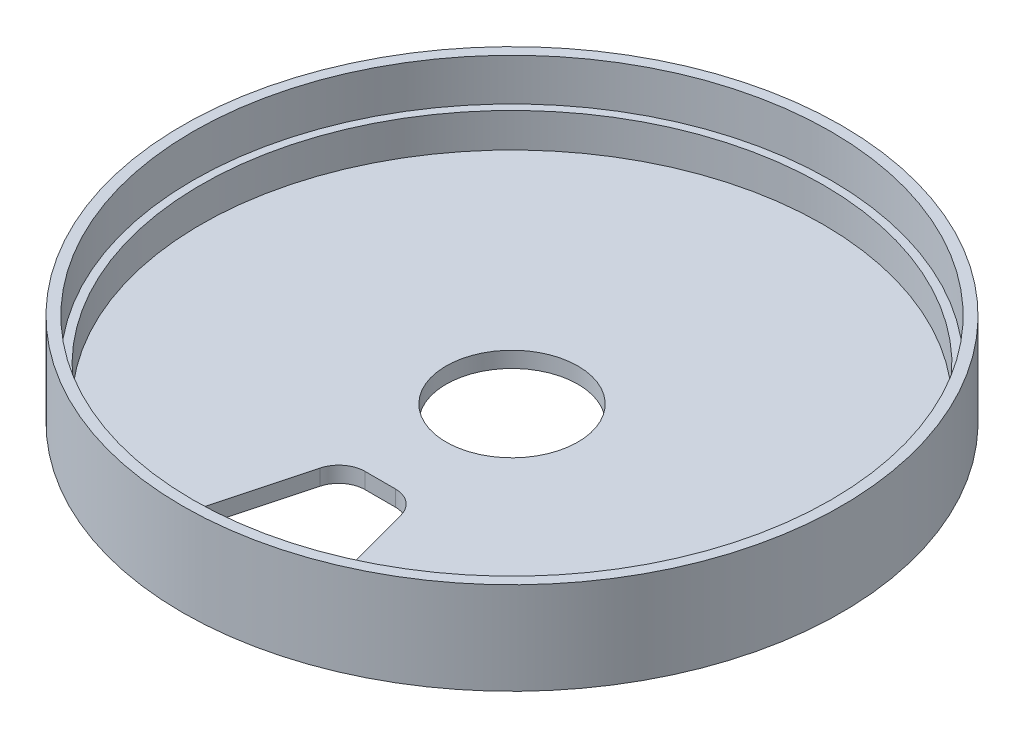
ISO-10303-21;
HEADER;
FILE_DESCRIPTION(('STEP AP214'),'2;1');
FILE_NAME('part.step','',(''),(''),'','','');
FILE_SCHEMA(('AUTOMOTIVE_DESIGN { 1 0 10303 214 1 1 1 1 }'));
ENDSEC;
DATA;
#1=APPLICATION_CONTEXT('core data for automotive mechanical design processes');
#2=APPLICATION_PROTOCOL_DEFINITION('international standard','automotive_design',2000,#1);
#3=PRODUCT_CONTEXT('',#1,'mechanical');
#4=PRODUCT('Part','Part','',(#3));
#5=PRODUCT_RELATED_PRODUCT_CATEGORY('part','',(#4));
#6=PRODUCT_DEFINITION_FORMATION('','',#4);
#7=PRODUCT_DEFINITION_CONTEXT('part definition',#1,'design');
#8=PRODUCT_DEFINITION('design','',#6,#7);
#9=PRODUCT_DEFINITION_SHAPE('','',#8);
#10=(LENGTH_UNIT() NAMED_UNIT(*) SI_UNIT(.MILLI.,.METRE.));
#11=(NAMED_UNIT(*) PLANE_ANGLE_UNIT() SI_UNIT($,.RADIAN.));
#12=(NAMED_UNIT(*) SI_UNIT($,.STERADIAN.) SOLID_ANGLE_UNIT());
#13=UNCERTAINTY_MEASURE_WITH_UNIT(LENGTH_MEASURE(1.E-05),#10,'distance_accuracy_value','');
#14=(GEOMETRIC_REPRESENTATION_CONTEXT(3) GLOBAL_UNCERTAINTY_ASSIGNED_CONTEXT((#13)) GLOBAL_UNIT_ASSIGNED_CONTEXT((#10,
#11,#12)) REPRESENTATION_CONTEXT('',''));
#15=CARTESIAN_POINT('',(0.,0.,0.));
#16=DIRECTION('',(0.,0.,1.));
#17=DIRECTION('',(1.,0.,0.));
#18=AXIS2_PLACEMENT_3D('',#15,#16,#17);
#19=CARTESIAN_POINT('',(0.,0.,0.));
#20=DIRECTION('',(0.,-1.,0.));
#21=DIRECTION('',(0.,0.,-1.));
#22=AXIS2_PLACEMENT_3D('',#19,#20,#21);
#23=CYLINDRICAL_SURFACE('',#22,12.5);
#24=CARTESIAN_POINT('',(0.,0.,0.));
#25=DIRECTION('',(0.,-1.,0.));
#26=DIRECTION('',(0.,0.,-1.));
#27=AXIS2_PLACEMENT_3D('',#24,#25,#26);
#28=CIRCLE('',#27,12.5);
#29=CARTESIAN_POINT('',(0.,0.,-12.5));
#30=VERTEX_POINT('',#29);
#31=EDGE_CURVE('E207',#30,#30,#28,.T.);
#32=ORIENTED_EDGE('',*,*,#31,.T.);
#33=EDGE_LOOP('',(#32));
#34=FACE_BOUND('',#33,.T.);
#35=CARTESIAN_POINT('',(0.,3.,0.));
#36=DIRECTION('',(0.,-1.,0.));
#37=DIRECTION('',(0.,0.,-1.));
#38=AXIS2_PLACEMENT_3D('',#35,#36,#37);
#39=CIRCLE('',#38,12.5);
#40=CARTESIAN_POINT('',(0.,3.,-12.5));
#41=VERTEX_POINT('',#40);
#42=EDGE_CURVE('E162',#41,#41,#39,.T.);
#43=ORIENTED_EDGE('',*,*,#42,.F.);
#44=EDGE_LOOP('',(#43));
#45=FACE_BOUND('',#44,.T.);
#46=ADVANCED_FACE('F41',(#34,#45),#23,.F.);
#47=CARTESIAN_POINT('',(12.5,0.,0.));
#48=DIRECTION('',(0.,-1.,0.));
#49=DIRECTION('',(0.,0.,-1.));
#50=AXIS2_PLACEMENT_3D('',#47,#48,#49);
#51=PLANE('',#50);
#52=DIRECTION('',(1.,0.,0.));
#53=VECTOR('',#52,1.);
#54=CARTESIAN_POINT('',(0.,0.,25.));
#55=LINE('',#54,#53);
#56=CARTESIAN_POINT('',(-2.86209487088327,0.,25.));
#57=VERTEX_POINT('',#56);
#58=CARTESIAN_POINT('',(2.86209487088327,0.,25.));
#59=VERTEX_POINT('',#58);
#60=EDGE_CURVE('E157',#57,#59,#55,.T.);
#61=ORIENTED_EDGE('',*,*,#60,.F.);
#62=CARTESIAN_POINT('',(-2.86209487088327,0.,30.));
#63=DIRECTION('',(0.,-1.,0.));
#64=DIRECTION('',(0.,0.,-1.));
#65=AXIS2_PLACEMENT_3D('',#62,#63,#64);
#66=CIRCLE('',#65,5.);
#67=CARTESIAN_POINT('',(-7.69172400232861,0.,28.7059047744874));
#68=VERTEX_POINT('',#67);
#69=EDGE_CURVE('E50',#57,#68,#66,.F.);
#70=ORIENTED_EDGE('',*,*,#69,.T.);
#71=DIRECTION('',(-0.258819045102521,0.,0.965925826289068));
#72=VECTOR('',#71,1.);
#73=CARTESIAN_POINT('',(0.,0.,0.));
#74=LINE('',#73,#72);
#75=CARTESIAN_POINT('',(-12.876084918047,0.,48.0542031167227));
#76=VERTEX_POINT('',#75);
#77=EDGE_CURVE('E156',#68,#76,#74,.T.);
#78=ORIENTED_EDGE('',*,*,#77,.T.);
#79=CARTESIAN_POINT('',(-8.04645578660166,0.,49.3482983422353));
#80=DIRECTION('',(0.,-1.,0.));
#81=DIRECTION('',(0.,0.,-1.));
#82=AXIS2_PLACEMENT_3D('',#79,#80,#81);
#83=CIRCLE('',#82,5.);
#84=CARTESIAN_POINT('',(-8.85110136526182,0.,54.2831281764588));
#85=VERTEX_POINT('',#84);
#86=EDGE_CURVE('E141',#76,#85,#83,.F.);
#87=ORIENTED_EDGE('',*,*,#86,.T.);
#88=CARTESIAN_POINT('',(0.,0.,0.));
#89=DIRECTION('',(0.,-1.,0.));
#90=DIRECTION('',(0.,0.,-1.));
#91=AXIS2_PLACEMENT_3D('',#88,#89,#90);
#92=CIRCLE('',#91,55.);
#93=CARTESIAN_POINT('',(8.85110136526182,0.,54.2831281764588));
#94=VERTEX_POINT('',#93);
#95=EDGE_CURVE('E115',#94,#85,#92,.T.);
#96=ORIENTED_EDGE('',*,*,#95,.F.);
#97=CARTESIAN_POINT('',(8.04645578660166,0.,49.3482983422353));
#98=DIRECTION('',(0.,-1.,0.));
#99=DIRECTION('',(0.,0.,-1.));
#100=AXIS2_PLACEMENT_3D('',#97,#98,#99);
#101=CIRCLE('',#100,5.);
#102=CARTESIAN_POINT('',(12.876084918047,0.,48.0542031167227));
#103=VERTEX_POINT('',#102);
#104=EDGE_CURVE('E181',#94,#103,#101,.F.);
#105=ORIENTED_EDGE('',*,*,#104,.T.);
#106=DIRECTION('',(0.258819045102521,0.,0.965925826289068));
#107=VECTOR('',#106,1.);
#108=CARTESIAN_POINT('',(0.,0.,0.));
#109=LINE('',#108,#107);
#110=CARTESIAN_POINT('',(7.69172400232861,0.,28.7059047744874));
#111=VERTEX_POINT('',#110);
#112=EDGE_CURVE('E185',#111,#103,#109,.T.);
#113=ORIENTED_EDGE('',*,*,#112,.F.);
#114=CARTESIAN_POINT('',(2.86209487088327,0.,30.));
#115=DIRECTION('',(0.,-1.,0.));
#116=DIRECTION('',(0.,0.,-1.));
#117=AXIS2_PLACEMENT_3D('',#114,#115,#116);
#118=CIRCLE('',#117,5.);
#119=EDGE_CURVE('E57',#111,#59,#118,.F.);
#120=ORIENTED_EDGE('',*,*,#119,.T.);
#121=EDGE_LOOP('',(#61,#70,#78,#87,#96,#105,#113,#120));
#122=FACE_BOUND('',#121,.T.);
#123=CARTESIAN_POINT('',(0.,0.,0.));
#124=DIRECTION('',(0.,-1.,0.));
#125=DIRECTION('',(0.,0.,-1.));
#126=AXIS2_PLACEMENT_3D('',#123,#124,#125);
#127=CIRCLE('',#126,62.5);
#128=CARTESIAN_POINT('',(0.,0.,-62.5));
#129=VERTEX_POINT('',#128);
#130=EDGE_CURVE('E211',#129,#129,#127,.T.);
#131=ORIENTED_EDGE('',*,*,#130,.T.);
#132=EDGE_LOOP('',(#131));
#133=FACE_BOUND('',#132,.T.);
#134=ORIENTED_EDGE('',*,*,#31,.F.);
#135=EDGE_LOOP('',(#134));
#136=FACE_BOUND('',#135,.T.);
#137=ADVANCED_FACE('F154',(#122,#133,#136),#51,.T.);
#138=CARTESIAN_POINT('',(0.,0.,0.));
#139=DIRECTION('',(0.,-1.,0.));
#140=DIRECTION('',(0.,0.,-1.));
#141=AXIS2_PLACEMENT_3D('',#138,#139,#140);
#142=CYLINDRICAL_SURFACE('',#141,62.5);
#143=CARTESIAN_POINT('',(0.,17.5,0.));
#144=DIRECTION('',(0.,-1.,0.));
#145=DIRECTION('',(0.,0.,-1.));
#146=AXIS2_PLACEMENT_3D('',#143,#144,#145);
#147=CIRCLE('',#146,62.5);
#148=CARTESIAN_POINT('',(0.,17.5,-62.5));
#149=VERTEX_POINT('',#148);
#150=EDGE_CURVE('E215',#149,#149,#147,.T.);
#151=ORIENTED_EDGE('',*,*,#150,.T.);
#152=EDGE_LOOP('',(#151));
#153=FACE_BOUND('',#152,.T.);
#154=ORIENTED_EDGE('',*,*,#130,.F.);
#155=EDGE_LOOP('',(#154));
#156=FACE_BOUND('',#155,.T.);
#157=ADVANCED_FACE('F259',(#153,#156),#142,.T.);
#158=CARTESIAN_POINT('',(62.5,17.5,0.));
#159=DIRECTION('',(0.,1.,0.));
#160=DIRECTION('',(0.,0.,1.));
#161=AXIS2_PLACEMENT_3D('',#158,#159,#160);
#162=PLANE('',#161);
#163=CARTESIAN_POINT('',(0.,17.5,0.));
#164=DIRECTION('',(0.,-1.,0.));
#165=DIRECTION('',(0.,0.,-1.));
#166=AXIS2_PLACEMENT_3D('',#163,#164,#165);
#167=CIRCLE('',#166,60.5);
#168=CARTESIAN_POINT('',(0.,17.5,-60.5));
#169=VERTEX_POINT('',#168);
#170=EDGE_CURVE('E219',#169,#169,#167,.T.);
#171=ORIENTED_EDGE('',*,*,#170,.T.);
#172=EDGE_LOOP('',(#171));
#173=FACE_BOUND('',#172,.T.);
#174=ORIENTED_EDGE('',*,*,#150,.F.);
#175=EDGE_LOOP('',(#174));
#176=FACE_BOUND('',#175,.T.);
#177=ADVANCED_FACE('F290',(#173,#176),#162,.T.);
#178=CARTESIAN_POINT('',(0.,0.,0.));
#179=DIRECTION('',(0.,-1.,0.));
#180=DIRECTION('',(0.,0.,-1.));
#181=AXIS2_PLACEMENT_3D('',#178,#179,#180);
#182=CYLINDRICAL_SURFACE('',#181,60.5);
#183=CARTESIAN_POINT('',(0.,9.5,0.));
#184=DIRECTION('',(0.,-1.,0.));
#185=DIRECTION('',(0.,0.,-1.));
#186=AXIS2_PLACEMENT_3D('',#183,#184,#185);
#187=CIRCLE('',#186,60.5);
#188=CARTESIAN_POINT('',(0.,9.5,-60.5));
#189=VERTEX_POINT('',#188);
#190=EDGE_CURVE('E223',#189,#189,#187,.T.);
#191=ORIENTED_EDGE('',*,*,#190,.T.);
#192=EDGE_LOOP('',(#191));
#193=FACE_BOUND('',#192,.T.);
#194=ORIENTED_EDGE('',*,*,#170,.F.);
#195=EDGE_LOOP('',(#194));
#196=FACE_BOUND('',#195,.T.);
#197=ADVANCED_FACE('F286',(#193,#196),#182,.F.);
#198=CARTESIAN_POINT('',(60.5,9.5,0.));
#199=DIRECTION('',(0.,1.,0.));
#200=DIRECTION('',(0.,0.,1.));
#201=AXIS2_PLACEMENT_3D('',#198,#199,#200);
#202=PLANE('',#201);
#203=CARTESIAN_POINT('',(0.,9.5,0.));
#204=DIRECTION('',(0.,-1.,0.));
#205=DIRECTION('',(0.,0.,-1.));
#206=AXIS2_PLACEMENT_3D('',#203,#204,#205);
#207=CIRCLE('',#206,59.);
#208=CARTESIAN_POINT('',(0.,9.5,-59.));
#209=VERTEX_POINT('',#208);
#210=EDGE_CURVE('E227',#209,#209,#207,.T.);
#211=ORIENTED_EDGE('',*,*,#210,.T.);
#212=EDGE_LOOP('',(#211));
#213=FACE_BOUND('',#212,.T.);
#214=ORIENTED_EDGE('',*,*,#190,.F.);
#215=EDGE_LOOP('',(#214));
#216=FACE_BOUND('',#215,.T.);
#217=ADVANCED_FACE('F282',(#213,#216),#202,.T.);
#218=CARTESIAN_POINT('',(0.,0.,0.));
#219=DIRECTION('',(0.,-1.,0.));
#220=DIRECTION('',(0.,0.,-1.));
#221=AXIS2_PLACEMENT_3D('',#218,#219,#220);
#222=CYLINDRICAL_SURFACE('',#221,59.);
#223=CARTESIAN_POINT('',(0.,3.,0.));
#224=DIRECTION('',(0.,-1.,0.));
#225=DIRECTION('',(0.,0.,-1.));
#226=AXIS2_PLACEMENT_3D('',#223,#224,#225);
#227=CIRCLE('',#226,59.);
#228=CARTESIAN_POINT('',(0.,3.,-59.));
#229=VERTEX_POINT('',#228);
#230=EDGE_CURVE('E231',#229,#229,#227,.T.);
#231=ORIENTED_EDGE('',*,*,#230,.T.);
#232=EDGE_LOOP('',(#231));
#233=FACE_BOUND('',#232,.T.);
#234=ORIENTED_EDGE('',*,*,#210,.F.);
#235=EDGE_LOOP('',(#234));
#236=FACE_BOUND('',#235,.T.);
#237=ADVANCED_FACE('F279',(#233,#236),#222,.F.);
#238=CARTESIAN_POINT('',(59.,3.,0.));
#239=DIRECTION('',(0.,1.,0.));
#240=DIRECTION('',(0.,0.,1.));
#241=AXIS2_PLACEMENT_3D('',#238,#239,#240);
#242=PLANE('',#241);
#243=DIRECTION('',(-1.,0.,0.));
#244=VECTOR('',#243,1.);
#245=CARTESIAN_POINT('',(59.,3.,25.));
#246=LINE('',#245,#244);
#247=CARTESIAN_POINT('',(2.86209487088327,3.,25.));
#248=VERTEX_POINT('',#247);
#249=CARTESIAN_POINT('',(-2.86209487088327,3.,25.));
#250=VERTEX_POINT('',#249);
#251=EDGE_CURVE('E120',#248,#250,#246,.T.);
#252=ORIENTED_EDGE('',*,*,#251,.F.);
#253=CARTESIAN_POINT('',(2.86209487088327,3.,30.));
#254=DIRECTION('',(0.,1.,0.));
#255=DIRECTION('',(0.,0.,1.));
#256=AXIS2_PLACEMENT_3D('',#253,#254,#255);
#257=CIRCLE('',#256,5.);
#258=CARTESIAN_POINT('',(7.69172400232862,3.,28.7059047744874));
#259=VERTEX_POINT('',#258);
#260=EDGE_CURVE('E145',#248,#259,#257,.F.);
#261=ORIENTED_EDGE('',*,*,#260,.T.);
#262=DIRECTION('',(-0.258819045102521,0.,-0.965925826289068));
#263=VECTOR('',#262,1.);
#264=CARTESIAN_POINT('',(3.95225058835907,3.,14.75));
#265=LINE('',#264,#263);
#266=CARTESIAN_POINT('',(12.876084918047,3.,48.0542031167227));
#267=VERTEX_POINT('',#266);
#268=EDGE_CURVE('E134',#267,#259,#265,.T.);
#269=ORIENTED_EDGE('',*,*,#268,.F.);
#270=CARTESIAN_POINT('',(8.04645578660166,3.,49.3482983422353));
#271=DIRECTION('',(0.,1.,0.));
#272=DIRECTION('',(0.,0.,1.));
#273=AXIS2_PLACEMENT_3D('',#270,#271,#272);
#274=CIRCLE('',#273,5.);
#275=CARTESIAN_POINT('',(8.85110136526182,3.,54.2831281764588));
#276=VERTEX_POINT('',#275);
#277=EDGE_CURVE('E131',#267,#276,#274,.F.);
#278=ORIENTED_EDGE('',*,*,#277,.T.);
#279=CARTESIAN_POINT('',(0.,3.,0.));
#280=DIRECTION('',(0.,1.,0.));
#281=DIRECTION('',(0.,0.,1.));
#282=AXIS2_PLACEMENT_3D('',#279,#280,#281);
#283=CIRCLE('',#282,55.);
#284=CARTESIAN_POINT('',(-8.85110136526182,3.,54.2831281764588));
#285=VERTEX_POINT('',#284);
#286=EDGE_CURVE('E112',#285,#276,#283,.T.);
#287=ORIENTED_EDGE('',*,*,#286,.F.);
#288=CARTESIAN_POINT('',(-8.04645578660166,3.,49.3482983422353));
#289=DIRECTION('',(0.,1.,0.));
#290=DIRECTION('',(0.,0.,1.));
#291=AXIS2_PLACEMENT_3D('',#288,#289,#290);
#292=CIRCLE('',#291,5.);
#293=CARTESIAN_POINT('',(-12.876084918047,3.,48.0542031167227));
#294=VERTEX_POINT('',#293);
#295=EDGE_CURVE('E127',#285,#294,#292,.F.);
#296=ORIENTED_EDGE('',*,*,#295,.T.);
#297=DIRECTION('',(0.258819045102521,0.,-0.965925826289068));
#298=VECTOR('',#297,1.);
#299=CARTESIAN_POINT('',(3.95225058835907,3.,-14.75));
#300=LINE('',#299,#298);
#301=CARTESIAN_POINT('',(-7.6917240023286,3.,28.7059047744874));
#302=VERTEX_POINT('',#301);
#303=EDGE_CURVE('E133',#294,#302,#300,.T.);
#304=ORIENTED_EDGE('',*,*,#303,.T.);
#305=CARTESIAN_POINT('',(-2.86209487088327,3.,30.));
#306=DIRECTION('',(0.,1.,0.));
#307=DIRECTION('',(0.,0.,1.));
#308=AXIS2_PLACEMENT_3D('',#305,#306,#307);
#309=CIRCLE('',#308,5.);
#310=EDGE_CURVE('E11',#302,#250,#309,.F.);
#311=ORIENTED_EDGE('',*,*,#310,.T.);
#312=EDGE_LOOP('',(#252,#261,#269,#278,#287,#296,#304,#311));
#313=FACE_BOUND('',#312,.T.);
#314=ORIENTED_EDGE('',*,*,#42,.T.);
#315=EDGE_LOOP('',(#314));
#316=FACE_BOUND('',#315,.T.);
#317=ORIENTED_EDGE('',*,*,#230,.F.);
#318=EDGE_LOOP('',(#317));
#319=FACE_BOUND('',#318,.T.);
#320=ADVANCED_FACE('F124',(#313,#316,#319),#242,.T.);
#321=CARTESIAN_POINT('',(0.,17.5,25.));
#322=DIRECTION('',(0.,0.,-1.));
#323=DIRECTION('',(-1.,0.,0.));
#324=AXIS2_PLACEMENT_3D('',#321,#322,#323);
#325=PLANE('',#324);
#326=ORIENTED_EDGE('',*,*,#60,.T.);
#327=DIRECTION('',(0.,-1.,0.));
#328=VECTOR('',#327,1.);
#329=CARTESIAN_POINT('',(2.86209487088327,3.,25.));
#330=LINE('',#329,#328);
#331=EDGE_CURVE('E178',#59,#248,#330,.F.);
#332=ORIENTED_EDGE('',*,*,#331,.T.);
#333=ORIENTED_EDGE('',*,*,#251,.T.);
#334=DIRECTION('',(0.,-1.,0.));
#335=VECTOR('',#334,1.);
#336=CARTESIAN_POINT('',(-2.86209487088327,17.5,25.));
#337=LINE('',#336,#335);
#338=EDGE_CURVE('E170',#250,#57,#337,.T.);
#339=ORIENTED_EDGE('',*,*,#338,.T.);
#340=EDGE_LOOP('',(#326,#332,#333,#339));
#341=FACE_BOUND('',#340,.T.);
#342=ADVANCED_FACE('F243',(#341),#325,.F.);
#343=CARTESIAN_POINT('',(0.,17.5,0.));
#344=DIRECTION('',(0.965925826289068,0.,0.258819045102521));
#345=DIRECTION('',(0.258819045102521,0.,-0.965925826289068));
#346=AXIS2_PLACEMENT_3D('',#343,#344,#345);
#347=PLANE('',#346);
#348=ORIENTED_EDGE('',*,*,#303,.F.);
#349=DIRECTION('',(0.,-1.,0.));
#350=VECTOR('',#349,1.);
#351=CARTESIAN_POINT('',(-12.876084918047,17.5,48.0542031167227));
#352=LINE('',#351,#350);
#353=EDGE_CURVE('E139',#294,#76,#352,.T.);
#354=ORIENTED_EDGE('',*,*,#353,.T.);
#355=ORIENTED_EDGE('',*,*,#77,.F.);
#356=DIRECTION('',(0.,-1.,0.));
#357=VECTOR('',#356,1.);
#358=CARTESIAN_POINT('',(-7.69172400232861,17.5,28.7059047744874));
#359=LINE('',#358,#357);
#360=EDGE_CURVE('E160',#68,#302,#359,.F.);
#361=ORIENTED_EDGE('',*,*,#360,.T.);
#362=EDGE_LOOP('',(#348,#354,#355,#361));
#363=FACE_BOUND('',#362,.T.);
#364=ADVANCED_FACE('F159',(#363),#347,.T.);
#365=CARTESIAN_POINT('',(0.,17.5,0.));
#366=DIRECTION('',(0.,-1.,0.));
#367=DIRECTION('',(0.,0.,-1.));
#368=AXIS2_PLACEMENT_3D('',#365,#366,#367);
#369=CYLINDRICAL_SURFACE('',#368,55.);
#370=ORIENTED_EDGE('',*,*,#286,.T.);
#371=DIRECTION('',(0.,-1.,0.));
#372=VECTOR('',#371,1.);
#373=CARTESIAN_POINT('',(8.85110136526182,17.5,54.2831281764589));
#374=LINE('',#373,#372);
#375=EDGE_CURVE('E119',#276,#94,#374,.T.);
#376=ORIENTED_EDGE('',*,*,#375,.T.);
#377=ORIENTED_EDGE('',*,*,#95,.T.);
#378=DIRECTION('',(0.,-1.,0.));
#379=VECTOR('',#378,1.);
#380=CARTESIAN_POINT('',(-8.85110136526182,17.5,54.2831281764589));
#381=LINE('',#380,#379);
#382=EDGE_CURVE('E108',#85,#285,#381,.F.);
#383=ORIENTED_EDGE('',*,*,#382,.T.);
#384=EDGE_LOOP('',(#370,#376,#377,#383));
#385=FACE_BOUND('',#384,.T.);
#386=ADVANCED_FACE('F110',(#385),#369,.F.);
#387=CARTESIAN_POINT('',(0.,17.5,0.));
#388=DIRECTION('',(0.965925826289068,0.,-0.258819045102521));
#389=DIRECTION('',(-0.258819045102521,0.,-0.965925826289068));
#390=AXIS2_PLACEMENT_3D('',#387,#388,#389);
#391=PLANE('',#390);
#392=ORIENTED_EDGE('',*,*,#112,.T.);
#393=DIRECTION('',(0.,1.,0.));
#394=VECTOR('',#393,1.);
#395=CARTESIAN_POINT('',(12.876084918047,3.,48.0542031167227));
#396=LINE('',#395,#394);
#397=EDGE_CURVE('E166',#103,#267,#396,.T.);
#398=ORIENTED_EDGE('',*,*,#397,.T.);
#399=ORIENTED_EDGE('',*,*,#268,.T.);
#400=DIRECTION('',(0.,-1.,0.));
#401=VECTOR('',#400,1.);
#402=CARTESIAN_POINT('',(7.69172400232861,0.,28.7059047744874));
#403=LINE('',#402,#401);
#404=EDGE_CURVE('E172',#259,#111,#403,.T.);
#405=ORIENTED_EDGE('',*,*,#404,.T.);
#406=EDGE_LOOP('',(#392,#398,#399,#405));
#407=FACE_BOUND('',#406,.T.);
#408=ADVANCED_FACE('F190',(#407),#391,.F.);
#409=CARTESIAN_POINT('',(8.04645578660166,17.5,49.3482983422353));
#410=DIRECTION('',(0.,-1.,0.));
#411=DIRECTION('',(0.,0.,-1.));
#412=AXIS2_PLACEMENT_3D('',#409,#410,#411);
#413=CYLINDRICAL_SURFACE('',#412,5.);
#414=ORIENTED_EDGE('',*,*,#277,.F.);
#415=ORIENTED_EDGE('',*,*,#397,.F.);
#416=ORIENTED_EDGE('',*,*,#104,.F.);
#417=ORIENTED_EDGE('',*,*,#375,.F.);
#418=EDGE_LOOP('',(#414,#415,#416,#417));
#419=FACE_BOUND('',#418,.T.);
#420=ADVANCED_FACE('F195',(#419),#413,.F.);
#421=CARTESIAN_POINT('',(-8.04645578660166,17.5,49.3482983422353));
#422=DIRECTION('',(0.,-1.,0.));
#423=DIRECTION('',(0.,0.,-1.));
#424=AXIS2_PLACEMENT_3D('',#421,#422,#423);
#425=CYLINDRICAL_SURFACE('',#424,5.);
#426=ORIENTED_EDGE('',*,*,#295,.F.);
#427=ORIENTED_EDGE('',*,*,#382,.F.);
#428=ORIENTED_EDGE('',*,*,#86,.F.);
#429=ORIENTED_EDGE('',*,*,#353,.F.);
#430=EDGE_LOOP('',(#426,#427,#428,#429));
#431=FACE_BOUND('',#430,.T.);
#432=ADVANCED_FACE('F137',(#431),#425,.F.);
#433=CARTESIAN_POINT('',(2.86209487088327,17.5,30.));
#434=DIRECTION('',(0.,1.,0.));
#435=DIRECTION('',(0.,0.,1.));
#436=AXIS2_PLACEMENT_3D('',#433,#434,#435);
#437=CYLINDRICAL_SURFACE('',#436,5.);
#438=ORIENTED_EDGE('',*,*,#260,.F.);
#439=ORIENTED_EDGE('',*,*,#331,.F.);
#440=ORIENTED_EDGE('',*,*,#119,.F.);
#441=ORIENTED_EDGE('',*,*,#404,.F.);
#442=EDGE_LOOP('',(#438,#439,#440,#441));
#443=FACE_BOUND('',#442,.T.);
#444=ADVANCED_FACE('F246',(#443),#437,.F.);
#445=CARTESIAN_POINT('',(-2.86209487088327,17.5,30.));
#446=DIRECTION('',(0.,-1.,0.));
#447=DIRECTION('',(0.,0.,-1.));
#448=AXIS2_PLACEMENT_3D('',#445,#446,#447);
#449=CYLINDRICAL_SURFACE('',#448,5.);
#450=ORIENTED_EDGE('',*,*,#310,.F.);
#451=ORIENTED_EDGE('',*,*,#360,.F.);
#452=ORIENTED_EDGE('',*,*,#69,.F.);
#453=ORIENTED_EDGE('',*,*,#338,.F.);
#454=EDGE_LOOP('',(#450,#451,#452,#453));
#455=FACE_BOUND('',#454,.T.);
#456=ADVANCED_FACE('F43',(#455),#449,.F.);
#457=CLOSED_SHELL('',(#46,#137,#157,#177,#197,#217,#237,#320,#342,#364,#386,#408,#420,#432,#444,#456));
#458=MANIFOLD_SOLID_BREP('B2',#457);
#459=ADVANCED_BREP_SHAPE_REPRESENTATION('',(#18,#458),#14);
#460=SHAPE_DEFINITION_REPRESENTATION(#9,#459);
ENDSEC;
END-ISO-10303-21;
